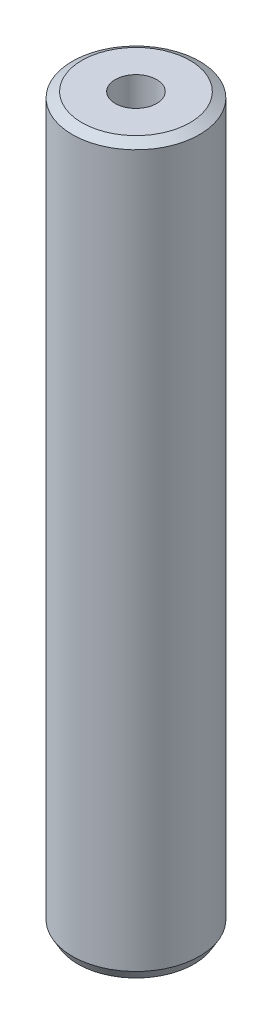
ISO-10303-21;
HEADER;
FILE_DESCRIPTION(('STEP AP214'),'2;1');
FILE_NAME('part.step','',(''),(''),'','','');
FILE_SCHEMA(('AUTOMOTIVE_DESIGN { 1 0 10303 214 1 1 1 1 }'));
ENDSEC;
DATA;
#1=APPLICATION_CONTEXT('core data for automotive mechanical design processes');
#2=APPLICATION_PROTOCOL_DEFINITION('international standard','automotive_design',2000,#1);
#3=PRODUCT_CONTEXT('',#1,'mechanical');
#4=PRODUCT('Part','Part','',(#3));
#5=PRODUCT_RELATED_PRODUCT_CATEGORY('part','',(#4));
#6=PRODUCT_DEFINITION_FORMATION('','',#4);
#7=PRODUCT_DEFINITION_CONTEXT('part definition',#1,'design');
#8=PRODUCT_DEFINITION('design','',#6,#7);
#9=PRODUCT_DEFINITION_SHAPE('','',#8);
#10=(LENGTH_UNIT() NAMED_UNIT(*) SI_UNIT(.MILLI.,.METRE.));
#11=(NAMED_UNIT(*) PLANE_ANGLE_UNIT() SI_UNIT($,.RADIAN.));
#12=(NAMED_UNIT(*) SI_UNIT($,.STERADIAN.) SOLID_ANGLE_UNIT());
#13=UNCERTAINTY_MEASURE_WITH_UNIT(LENGTH_MEASURE(1.E-05),#10,'distance_accuracy_value','');
#14=(GEOMETRIC_REPRESENTATION_CONTEXT(3) GLOBAL_UNCERTAINTY_ASSIGNED_CONTEXT((#13)) GLOBAL_UNIT_ASSIGNED_CONTEXT((#10,
#11,#12)) REPRESENTATION_CONTEXT('',''));
#15=CARTESIAN_POINT('',(0.,0.,0.));
#16=DIRECTION('',(0.,0.,1.));
#17=DIRECTION('',(1.,0.,0.));
#18=AXIS2_PLACEMENT_3D('',#15,#16,#17);
#19=CARTESIAN_POINT('',(0.,600.,0.));
#20=DIRECTION('',(0.,-1.,0.));
#21=DIRECTION('',(0.,0.,-1.));
#22=AXIS2_PLACEMENT_3D('',#19,#20,#21);
#23=CYLINDRICAL_SURFACE('',#22,52.5);
#24=CARTESIAN_POINT('',(0.,595.442413379863,0.));
#25=DIRECTION('',(0.,1.,0.));
#26=DIRECTION('',(0.,0.,1.));
#27=AXIS2_PLACEMENT_3D('',#24,#25,#26);
#28=CIRCLE('',#27,52.5);
#29=CARTESIAN_POINT('',(0.,595.442413379863,52.5));
#30=VERTEX_POINT('',#29);
#31=EDGE_CURVE('E50',#30,#30,#28,.F.);
#32=ORIENTED_EDGE('',*,*,#31,.T.);
#33=EDGE_LOOP('',(#32));
#34=FACE_BOUND('',#33,.T.);
#35=CARTESIAN_POINT('',(0.,7.89397158597449,0.));
#36=DIRECTION('',(0.,1.,0.));
#37=DIRECTION('',(0.,0.,1.));
#38=AXIS2_PLACEMENT_3D('',#35,#36,#37);
#39=CIRCLE('',#38,52.5);
#40=CARTESIAN_POINT('',(0.,7.89397158597449,52.5));
#41=VERTEX_POINT('',#40);
#42=EDGE_CURVE('E51',#41,#41,#39,.T.);
#43=ORIENTED_EDGE('',*,*,#42,.T.);
#44=EDGE_LOOP('',(#43));
#45=FACE_BOUND('',#44,.T.);
#46=ADVANCED_FACE('F39',(#34,#45),#23,.T.);
#47=CARTESIAN_POINT('',(0.,600.,0.));
#48=DIRECTION('',(0.,1.,0.));
#49=DIRECTION('',(0.,0.,1.));
#50=AXIS2_PLACEMENT_3D('',#47,#48,#49);
#51=PLANE('',#50);
#52=CARTESIAN_POINT('',(0.,600.,0.));
#53=DIRECTION('',(0.,1.,0.));
#54=DIRECTION('',(0.,0.,1.));
#55=AXIS2_PLACEMENT_3D('',#52,#53,#54);
#56=CIRCLE('',#55,44.6060284140257);
#57=CARTESIAN_POINT('',(0.,600.,44.6060284140257));
#58=VERTEX_POINT('',#57);
#59=EDGE_CURVE('E54',#58,#58,#56,.T.);
#60=ORIENTED_EDGE('',*,*,#59,.T.);
#61=EDGE_LOOP('',(#60));
#62=FACE_BOUND('',#61,.T.);
#63=CARTESIAN_POINT('',(0.,600.,0.));
#64=DIRECTION('',(0.,1.,0.));
#65=DIRECTION('',(0.,0.,1.));
#66=AXIS2_PLACEMENT_3D('',#63,#64,#65);
#67=CIRCLE('',#66,17.1156531413886);
#68=CARTESIAN_POINT('',(0.,600.,17.1156531413886));
#69=VERTEX_POINT('',#68);
#70=EDGE_CURVE('E58',#69,#69,#67,.T.);
#71=ORIENTED_EDGE('',*,*,#70,.F.);
#72=EDGE_LOOP('',(#71));
#73=FACE_BOUND('',#72,.T.);
#74=ADVANCED_FACE('F69',(#62,#73),#51,.T.);
#75=CARTESIAN_POINT('',(0.,0.,0.));
#76=DIRECTION('',(0.,1.,0.));
#77=DIRECTION('',(0.,0.,1.));
#78=AXIS2_PLACEMENT_3D('',#75,#76,#77);
#79=PLANE('',#78);
#80=CARTESIAN_POINT('',(0.,0.,0.));
#81=DIRECTION('',(0.,1.,0.));
#82=DIRECTION('',(0.,0.,1.));
#83=AXIS2_PLACEMENT_3D('',#80,#81,#82);
#84=CIRCLE('',#83,47.9424133798623);
#85=CARTESIAN_POINT('',(0.,0.,47.9424133798623));
#86=VERTEX_POINT('',#85);
#87=EDGE_CURVE('E10',#86,#86,#84,.F.);
#88=ORIENTED_EDGE('',*,*,#87,.T.);
#89=EDGE_LOOP('',(#88));
#90=FACE_BOUND('',#89,.T.);
#91=CARTESIAN_POINT('',(0.,0.,0.));
#92=DIRECTION('',(0.,1.,0.));
#93=DIRECTION('',(0.,0.,1.));
#94=AXIS2_PLACEMENT_3D('',#91,#92,#93);
#95=CIRCLE('',#94,17.1156531413886);
#96=CARTESIAN_POINT('',(0.,0.,17.1156531413886));
#97=VERTEX_POINT('',#96);
#98=EDGE_CURVE('E63',#97,#97,#95,.T.);
#99=ORIENTED_EDGE('',*,*,#98,.T.);
#100=EDGE_LOOP('',(#99));
#101=FACE_BOUND('',#100,.T.);
#102=ADVANCED_FACE('F75',(#90,#101),#79,.F.);
#103=CARTESIAN_POINT('',(0.,600.,0.));
#104=DIRECTION('',(0.,-1.,0.));
#105=DIRECTION('',(0.,0.,-1.));
#106=AXIS2_PLACEMENT_3D('',#103,#104,#105);
#107=CYLINDRICAL_SURFACE('',#106,17.1156531413886);
#108=ORIENTED_EDGE('',*,*,#70,.T.);
#109=EDGE_LOOP('',(#108));
#110=FACE_BOUND('',#109,.T.);
#111=ORIENTED_EDGE('',*,*,#98,.F.);
#112=EDGE_LOOP('',(#111));
#113=FACE_BOUND('',#112,.T.);
#114=ADVANCED_FACE('F70',(#110,#113),#107,.F.);
#115=CARTESIAN_POINT('',(0.,600.,0.));
#116=DIRECTION('',(0.,-1.,0.));
#117=DIRECTION('',(0.,0.,-1.));
#118=AXIS2_PLACEMENT_3D('',#115,#116,#117);
#119=CONICAL_SURFACE('',#118,44.6060284140257,1.0471975511966);
#120=ORIENTED_EDGE('',*,*,#31,.F.);
#121=EDGE_LOOP('',(#120));
#122=FACE_BOUND('',#121,.T.);
#123=ORIENTED_EDGE('',*,*,#59,.F.);
#124=EDGE_LOOP('',(#123));
#125=FACE_BOUND('',#124,.T.);
#126=ADVANCED_FACE('F81',(#122,#125),#119,.T.);
#127=CARTESIAN_POINT('',(0.,7.89397158597449,0.));
#128=DIRECTION('',(0.,1.,0.));
#129=DIRECTION('',(0.,0.,1.));
#130=AXIS2_PLACEMENT_3D('',#127,#128,#129);
#131=CONICAL_SURFACE('',#130,52.5,0.523598775598303);
#132=ORIENTED_EDGE('',*,*,#87,.F.);
#133=EDGE_LOOP('',(#132));
#134=FACE_BOUND('',#133,.T.);
#135=ORIENTED_EDGE('',*,*,#42,.F.);
#136=EDGE_LOOP('',(#135));
#137=FACE_BOUND('',#136,.T.);
#138=ADVANCED_FACE('F45',(#134,#137),#131,.T.);
#139=CLOSED_SHELL('',(#46,#74,#102,#114,#126,#138));
#140=MANIFOLD_SOLID_BREP('B2',#139);
#141=ADVANCED_BREP_SHAPE_REPRESENTATION('',(#18,#140),#14);
#142=SHAPE_DEFINITION_REPRESENTATION(#9,#141);
ENDSEC;
END-ISO-10303-21;
